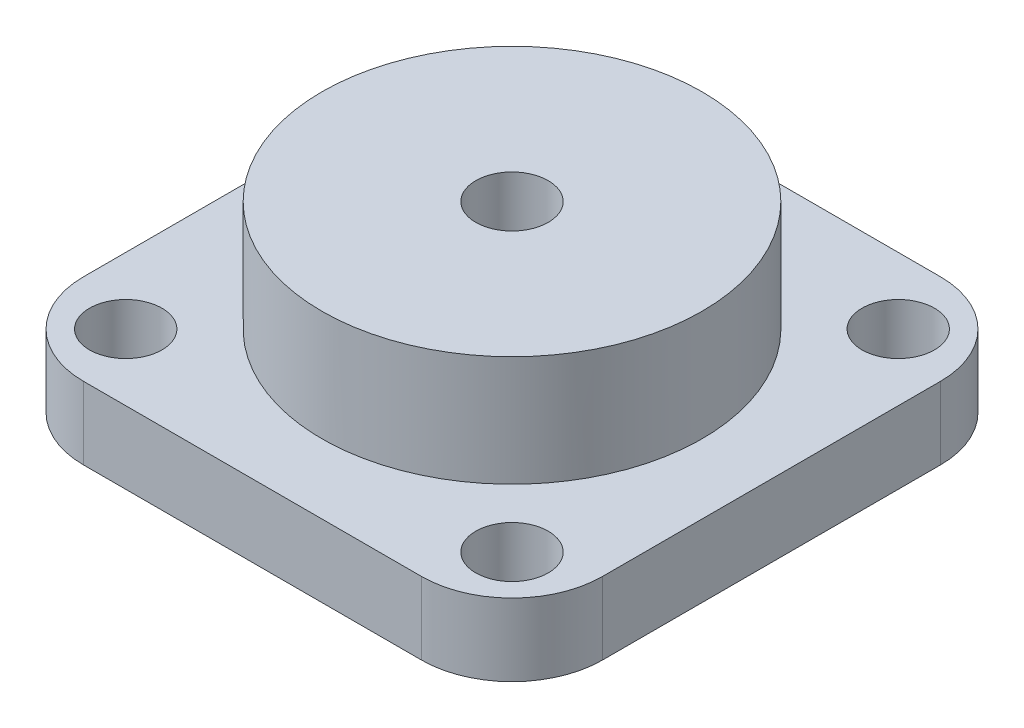
ISO-10303-21;
HEADER;
FILE_DESCRIPTION(('STEP AP214'),'2;1');
FILE_NAME('part.step','',(''),(''),'','','');
FILE_SCHEMA(('AUTOMOTIVE_DESIGN { 1 0 10303 214 1 1 1 1 }'));
ENDSEC;
DATA;
#1=APPLICATION_CONTEXT('core data for automotive mechanical design processes');
#2=APPLICATION_PROTOCOL_DEFINITION('international standard','automotive_design',2000,#1);
#3=PRODUCT_CONTEXT('',#1,'mechanical');
#4=PRODUCT('Part','Part','',(#3));
#5=PRODUCT_RELATED_PRODUCT_CATEGORY('part','',(#4));
#6=PRODUCT_DEFINITION_FORMATION('','',#4);
#7=PRODUCT_DEFINITION_CONTEXT('part definition',#1,'design');
#8=PRODUCT_DEFINITION('design','',#6,#7);
#9=PRODUCT_DEFINITION_SHAPE('','',#8);
#10=(LENGTH_UNIT() NAMED_UNIT(*) SI_UNIT(.MILLI.,.METRE.));
#11=(NAMED_UNIT(*) PLANE_ANGLE_UNIT() SI_UNIT($,.RADIAN.));
#12=(NAMED_UNIT(*) SI_UNIT($,.STERADIAN.) SOLID_ANGLE_UNIT());
#13=UNCERTAINTY_MEASURE_WITH_UNIT(LENGTH_MEASURE(1.E-05),#10,'distance_accuracy_value','');
#14=(GEOMETRIC_REPRESENTATION_CONTEXT(3) GLOBAL_UNCERTAINTY_ASSIGNED_CONTEXT((#13)) GLOBAL_UNIT_ASSIGNED_CONTEXT((#10,
#11,#12)) REPRESENTATION_CONTEXT('',''));
#15=CARTESIAN_POINT('',(0.,0.,0.));
#16=DIRECTION('',(0.,0.,1.));
#17=DIRECTION('',(1.,0.,0.));
#18=AXIS2_PLACEMENT_3D('',#15,#16,#17);
#19=CARTESIAN_POINT('',(-15.,12.,15.));
#20=DIRECTION('',(0.,-1.,0.));
#21=DIRECTION('',(0.,0.,-1.));
#22=AXIS2_PLACEMENT_3D('',#19,#20,#21);
#23=CYLINDRICAL_SURFACE('',#22,15.);
#24=CARTESIAN_POINT('',(-15.,0.,15.));
#25=DIRECTION('',(0.,1.,0.));
#26=DIRECTION('',(0.,0.,-1.));
#27=AXIS2_PLACEMENT_3D('',#24,#25,#26);
#28=CIRCLE('',#27,15.);
#29=CARTESIAN_POINT('',(0.,0.,15.0000000000001));
#30=VERTEX_POINT('',#29);
#31=CARTESIAN_POINT('',(-15.0000000000001,0.,0.));
#32=VERTEX_POINT('',#31);
#33=EDGE_CURVE('E141',#30,#32,#28,.T.);
#34=ORIENTED_EDGE('',*,*,#33,.T.);
#35=DIRECTION('',(0.,-1.,0.));
#36=VECTOR('',#35,1.);
#37=CARTESIAN_POINT('',(-15.0000000000001,12.,0.));
#38=LINE('',#37,#36);
#39=CARTESIAN_POINT('',(-15.0000000000001,12.,0.));
#40=VERTEX_POINT('',#39);
#41=EDGE_CURVE('E48',#40,#32,#38,.T.);
#42=ORIENTED_EDGE('',*,*,#41,.F.);
#43=CARTESIAN_POINT('',(-15.,12.,15.));
#44=DIRECTION('',(0.,1.,0.));
#45=DIRECTION('',(0.,0.,-1.));
#46=AXIS2_PLACEMENT_3D('',#43,#44,#45);
#47=CIRCLE('',#46,15.);
#48=CARTESIAN_POINT('',(0.,12.,15.0000000000001));
#49=VERTEX_POINT('',#48);
#50=EDGE_CURVE('E164',#49,#40,#47,.T.);
#51=ORIENTED_EDGE('',*,*,#50,.F.);
#52=DIRECTION('',(0.,-1.,0.));
#53=VECTOR('',#52,1.);
#54=CARTESIAN_POINT('',(0.,12.,15.0000000000001));
#55=LINE('',#54,#53);
#56=EDGE_CURVE('E137',#49,#30,#55,.T.);
#57=ORIENTED_EDGE('',*,*,#56,.T.);
#58=EDGE_LOOP('',(#34,#42,#51,#57));
#59=FACE_BOUND('',#58,.T.);
#60=ADVANCED_FACE('F39',(#59),#23,.T.);
#61=CARTESIAN_POINT('',(-15.0000000000001,12.,0.));
#62=DIRECTION('',(0.,0.,1.));
#63=DIRECTION('',(1.,0.,0.));
#64=AXIS2_PLACEMENT_3D('',#61,#62,#63);
#65=PLANE('',#64);
#66=DIRECTION('',(-1.,0.,0.));
#67=VECTOR('',#66,1.);
#68=CARTESIAN_POINT('',(-15.0000000000001,0.,0.));
#69=LINE('',#68,#67);
#70=CARTESIAN_POINT('',(-70.9999999999999,0.,0.));
#71=VERTEX_POINT('',#70);
#72=EDGE_CURVE('E145',#32,#71,#69,.T.);
#73=ORIENTED_EDGE('',*,*,#72,.T.);
#74=DIRECTION('',(0.,-1.,0.));
#75=VECTOR('',#74,1.);
#76=CARTESIAN_POINT('',(-70.9999999999999,12.,0.));
#77=LINE('',#76,#75);
#78=CARTESIAN_POINT('',(-70.9999999999999,12.,0.));
#79=VERTEX_POINT('',#78);
#80=EDGE_CURVE('E179',#79,#71,#77,.T.);
#81=ORIENTED_EDGE('',*,*,#80,.F.);
#82=DIRECTION('',(-1.,0.,0.));
#83=VECTOR('',#82,1.);
#84=CARTESIAN_POINT('',(-15.0000000000001,12.,0.));
#85=LINE('',#84,#83);
#86=EDGE_CURVE('E100',#40,#79,#85,.T.);
#87=ORIENTED_EDGE('',*,*,#86,.F.);
#88=ORIENTED_EDGE('',*,*,#41,.T.);
#89=EDGE_LOOP('',(#73,#81,#87,#88));
#90=FACE_BOUND('',#89,.T.);
#91=ADVANCED_FACE('F184',(#90),#65,.F.);
#92=CARTESIAN_POINT('',(-71.,12.,15.));
#93=DIRECTION('',(0.,-1.,0.));
#94=DIRECTION('',(0.,0.,-1.));
#95=AXIS2_PLACEMENT_3D('',#92,#93,#94);
#96=CYLINDRICAL_SURFACE('',#95,15.);
#97=CARTESIAN_POINT('',(-71.,0.,15.));
#98=DIRECTION('',(0.,1.,0.));
#99=DIRECTION('',(0.,0.,1.));
#100=AXIS2_PLACEMENT_3D('',#97,#98,#99);
#101=CIRCLE('',#100,15.);
#102=CARTESIAN_POINT('',(-86.,0.,15.0000000000001));
#103=VERTEX_POINT('',#102);
#104=EDGE_CURVE('E149',#71,#103,#101,.T.);
#105=ORIENTED_EDGE('',*,*,#104,.T.);
#106=DIRECTION('',(0.,-1.,0.));
#107=VECTOR('',#106,1.);
#108=CARTESIAN_POINT('',(-86.,12.,15.0000000000001));
#109=LINE('',#108,#107);
#110=CARTESIAN_POINT('',(-86.,12.,15.0000000000001));
#111=VERTEX_POINT('',#110);
#112=EDGE_CURVE('E175',#111,#103,#109,.T.);
#113=ORIENTED_EDGE('',*,*,#112,.F.);
#114=CARTESIAN_POINT('',(-71.,12.,15.));
#115=DIRECTION('',(0.,1.,0.));
#116=DIRECTION('',(0.,0.,1.));
#117=AXIS2_PLACEMENT_3D('',#114,#115,#116);
#118=CIRCLE('',#117,15.);
#119=EDGE_CURVE('E203',#79,#111,#118,.T.);
#120=ORIENTED_EDGE('',*,*,#119,.F.);
#121=ORIENTED_EDGE('',*,*,#80,.T.);
#122=EDGE_LOOP('',(#105,#113,#120,#121));
#123=FACE_BOUND('',#122,.T.);
#124=ADVANCED_FACE('F195',(#123),#96,.T.);
#125=CARTESIAN_POINT('',(-86.,12.,15.0000000000001));
#126=DIRECTION('',(1.,0.,0.));
#127=DIRECTION('',(0.,0.,-1.));
#128=AXIS2_PLACEMENT_3D('',#125,#126,#127);
#129=PLANE('',#128);
#130=DIRECTION('',(0.,0.,1.));
#131=VECTOR('',#130,1.);
#132=CARTESIAN_POINT('',(-86.,0.,15.0000000000001));
#133=LINE('',#132,#131);
#134=CARTESIAN_POINT('',(-86.,0.,70.9999999999999));
#135=VERTEX_POINT('',#134);
#136=EDGE_CURVE('E152',#103,#135,#133,.T.);
#137=ORIENTED_EDGE('',*,*,#136,.T.);
#138=DIRECTION('',(0.,-1.,0.));
#139=VECTOR('',#138,1.);
#140=CARTESIAN_POINT('',(-86.,12.,70.9999999999999));
#141=LINE('',#140,#139);
#142=CARTESIAN_POINT('',(-86.,12.,70.9999999999999));
#143=VERTEX_POINT('',#142);
#144=EDGE_CURVE('E171',#143,#135,#141,.T.);
#145=ORIENTED_EDGE('',*,*,#144,.F.);
#146=DIRECTION('',(0.,0.,1.));
#147=VECTOR('',#146,1.);
#148=CARTESIAN_POINT('',(-86.,12.,15.0000000000001));
#149=LINE('',#148,#147);
#150=EDGE_CURVE('E201',#111,#143,#149,.T.);
#151=ORIENTED_EDGE('',*,*,#150,.F.);
#152=ORIENTED_EDGE('',*,*,#112,.T.);
#153=EDGE_LOOP('',(#137,#145,#151,#152));
#154=FACE_BOUND('',#153,.T.);
#155=ADVANCED_FACE('F199',(#154),#129,.F.);
#156=CARTESIAN_POINT('',(-71.,12.,71.));
#157=DIRECTION('',(0.,-1.,0.));
#158=DIRECTION('',(0.,0.,-1.));
#159=AXIS2_PLACEMENT_3D('',#156,#157,#158);
#160=CYLINDRICAL_SURFACE('',#159,15.);
#161=CARTESIAN_POINT('',(-71.,0.,71.));
#162=DIRECTION('',(0.,1.,0.));
#163=DIRECTION('',(0.,0.,-1.));
#164=AXIS2_PLACEMENT_3D('',#161,#162,#163);
#165=CIRCLE('',#164,15.);
#166=CARTESIAN_POINT('',(-70.9999999999999,0.,86.));
#167=VERTEX_POINT('',#166);
#168=EDGE_CURVE('E155',#135,#167,#165,.T.);
#169=ORIENTED_EDGE('',*,*,#168,.T.);
#170=DIRECTION('',(0.,-1.,0.));
#171=VECTOR('',#170,1.);
#172=CARTESIAN_POINT('',(-70.9999999999999,12.,86.));
#173=LINE('',#172,#171);
#174=CARTESIAN_POINT('',(-70.9999999999999,12.,86.));
#175=VERTEX_POINT('',#174);
#176=EDGE_CURVE('E130',#175,#167,#173,.T.);
#177=ORIENTED_EDGE('',*,*,#176,.F.);
#178=CARTESIAN_POINT('',(-71.,12.,71.));
#179=DIRECTION('',(0.,1.,0.));
#180=DIRECTION('',(0.,0.,-1.));
#181=AXIS2_PLACEMENT_3D('',#178,#179,#180);
#182=CIRCLE('',#181,15.);
#183=EDGE_CURVE('E119',#143,#175,#182,.T.);
#184=ORIENTED_EDGE('',*,*,#183,.F.);
#185=ORIENTED_EDGE('',*,*,#144,.T.);
#186=EDGE_LOOP('',(#169,#177,#184,#185));
#187=FACE_BOUND('',#186,.T.);
#188=ADVANCED_FACE('F316',(#187),#160,.T.);
#189=CARTESIAN_POINT('',(-15.0000000000001,12.,86.));
#190=DIRECTION('',(0.,0.,-1.));
#191=DIRECTION('',(-1.,0.,0.));
#192=AXIS2_PLACEMENT_3D('',#189,#190,#191);
#193=PLANE('',#192);
#194=DIRECTION('',(1.,0.,0.));
#195=VECTOR('',#194,1.);
#196=CARTESIAN_POINT('',(-15.0000000000001,0.,86.));
#197=LINE('',#196,#195);
#198=CARTESIAN_POINT('',(-15.0000000000001,0.,86.));
#199=VERTEX_POINT('',#198);
#200=EDGE_CURVE('E128',#167,#199,#197,.T.);
#201=ORIENTED_EDGE('',*,*,#200,.T.);
#202=DIRECTION('',(0.,-1.,0.));
#203=VECTOR('',#202,1.);
#204=CARTESIAN_POINT('',(-15.0000000000001,12.,86.));
#205=LINE('',#204,#203);
#206=CARTESIAN_POINT('',(-15.0000000000001,12.,86.));
#207=VERTEX_POINT('',#206);
#208=EDGE_CURVE('E125',#207,#199,#205,.T.);
#209=ORIENTED_EDGE('',*,*,#208,.F.);
#210=DIRECTION('',(1.,0.,0.));
#211=VECTOR('',#210,1.);
#212=CARTESIAN_POINT('',(-15.0000000000001,12.,86.));
#213=LINE('',#212,#211);
#214=EDGE_CURVE('E113',#175,#207,#213,.T.);
#215=ORIENTED_EDGE('',*,*,#214,.F.);
#216=ORIENTED_EDGE('',*,*,#176,.T.);
#217=EDGE_LOOP('',(#201,#209,#215,#216));
#218=FACE_BOUND('',#217,.T.);
#219=ADVANCED_FACE('F126',(#218),#193,.F.);
#220=CARTESIAN_POINT('',(-15.,12.,71.));
#221=DIRECTION('',(0.,-1.,0.));
#222=DIRECTION('',(0.,0.,-1.));
#223=AXIS2_PLACEMENT_3D('',#220,#221,#222);
#224=CYLINDRICAL_SURFACE('',#223,15.);
#225=CARTESIAN_POINT('',(-15.,0.,71.));
#226=DIRECTION('',(0.,1.,0.));
#227=DIRECTION('',(0.,0.,-1.));
#228=AXIS2_PLACEMENT_3D('',#225,#226,#227);
#229=CIRCLE('',#228,15.);
#230=CARTESIAN_POINT('',(0.,0.,70.9999999999999));
#231=VERTEX_POINT('',#230);
#232=EDGE_CURVE('E85',#199,#231,#229,.T.);
#233=ORIENTED_EDGE('',*,*,#232,.T.);
#234=DIRECTION('',(0.,-1.,0.));
#235=VECTOR('',#234,1.);
#236=CARTESIAN_POINT('',(0.,12.,70.9999999999999));
#237=LINE('',#236,#235);
#238=CARTESIAN_POINT('',(0.,12.,70.9999999999999));
#239=VERTEX_POINT('',#238);
#240=EDGE_CURVE('E131',#239,#231,#237,.T.);
#241=ORIENTED_EDGE('',*,*,#240,.F.);
#242=CARTESIAN_POINT('',(-15.,12.,71.));
#243=DIRECTION('',(0.,1.,0.));
#244=DIRECTION('',(0.,0.,-1.));
#245=AXIS2_PLACEMENT_3D('',#242,#243,#244);
#246=CIRCLE('',#245,15.);
#247=EDGE_CURVE('E117',#207,#239,#246,.T.);
#248=ORIENTED_EDGE('',*,*,#247,.F.);
#249=ORIENTED_EDGE('',*,*,#208,.T.);
#250=EDGE_LOOP('',(#233,#241,#248,#249));
#251=FACE_BOUND('',#250,.T.);
#252=ADVANCED_FACE('F133',(#251),#224,.T.);
#253=CARTESIAN_POINT('',(0.,12.,15.0000000000001));
#254=DIRECTION('',(-1.,0.,0.));
#255=DIRECTION('',(0.,0.,1.));
#256=AXIS2_PLACEMENT_3D('',#253,#254,#255);
#257=PLANE('',#256);
#258=DIRECTION('',(0.,0.,-1.));
#259=VECTOR('',#258,1.);
#260=CARTESIAN_POINT('',(0.,0.,15.0000000000001));
#261=LINE('',#260,#259);
#262=EDGE_CURVE('E91',#231,#30,#261,.T.);
#263=ORIENTED_EDGE('',*,*,#262,.T.);
#264=ORIENTED_EDGE('',*,*,#56,.F.);
#265=DIRECTION('',(0.,0.,-1.));
#266=VECTOR('',#265,1.);
#267=CARTESIAN_POINT('',(0.,12.,15.0000000000001));
#268=LINE('',#267,#266);
#269=EDGE_CURVE('E56',#239,#49,#268,.T.);
#270=ORIENTED_EDGE('',*,*,#269,.F.);
#271=ORIENTED_EDGE('',*,*,#240,.T.);
#272=EDGE_LOOP('',(#263,#264,#270,#271));
#273=FACE_BOUND('',#272,.T.);
#274=ADVANCED_FACE('F280',(#273),#257,.F.);
#275=CARTESIAN_POINT('',(-15.,12.,15.));
#276=DIRECTION('',(0.,-1.,0.));
#277=DIRECTION('',(0.,0.,-1.));
#278=AXIS2_PLACEMENT_3D('',#275,#276,#277);
#279=PLANE('',#278);
#280=CARTESIAN_POINT('',(-43.,12.,43.));
#281=DIRECTION('',(0.,-1.,0.));
#282=DIRECTION('',(0.,0.,-1.));
#283=AXIS2_PLACEMENT_3D('',#280,#281,#282);
#284=CIRCLE('',#283,31.5);
#285=CARTESIAN_POINT('',(-43.,12.,11.5));
#286=VERTEX_POINT('',#285);
#287=EDGE_CURVE('E11',#286,#286,#284,.F.);
#288=ORIENTED_EDGE('',*,*,#287,.F.);
#289=EDGE_LOOP('',(#288));
#290=FACE_BOUND('',#289,.T.);
#291=CARTESIAN_POINT('',(-75.,12.,75.));
#292=DIRECTION('',(0.,1.,0.));
#293=DIRECTION('',(0.,0.,1.));
#294=AXIS2_PLACEMENT_3D('',#291,#292,#293);
#295=CIRCLE('',#294,6.);
#296=CARTESIAN_POINT('',(-75.,12.,81.));
#297=VERTEX_POINT('',#296);
#298=EDGE_CURVE('E221',#297,#297,#295,.T.);
#299=ORIENTED_EDGE('',*,*,#298,.F.);
#300=EDGE_LOOP('',(#299));
#301=FACE_BOUND('',#300,.T.);
#302=CARTESIAN_POINT('',(-11.,12.,75.));
#303=DIRECTION('',(0.,1.,0.));
#304=DIRECTION('',(0.,0.,1.));
#305=AXIS2_PLACEMENT_3D('',#302,#303,#304);
#306=CIRCLE('',#305,6.);
#307=CARTESIAN_POINT('',(-11.,12.,81.));
#308=VERTEX_POINT('',#307);
#309=EDGE_CURVE('E230',#308,#308,#306,.T.);
#310=ORIENTED_EDGE('',*,*,#309,.F.);
#311=EDGE_LOOP('',(#310));
#312=FACE_BOUND('',#311,.T.);
#313=CARTESIAN_POINT('',(-11.,12.,11.));
#314=DIRECTION('',(0.,1.,0.));
#315=DIRECTION('',(0.,0.,1.));
#316=AXIS2_PLACEMENT_3D('',#313,#314,#315);
#317=CIRCLE('',#316,6.);
#318=CARTESIAN_POINT('',(-11.,12.,17.));
#319=VERTEX_POINT('',#318);
#320=EDGE_CURVE('E238',#319,#319,#317,.T.);
#321=ORIENTED_EDGE('',*,*,#320,.F.);
#322=EDGE_LOOP('',(#321));
#323=FACE_BOUND('',#322,.T.);
#324=CARTESIAN_POINT('',(-75.,12.,11.));
#325=DIRECTION('',(0.,1.,0.));
#326=DIRECTION('',(0.,0.,1.));
#327=AXIS2_PLACEMENT_3D('',#324,#325,#326);
#328=CIRCLE('',#327,6.);
#329=CARTESIAN_POINT('',(-75.,12.,17.));
#330=VERTEX_POINT('',#329);
#331=EDGE_CURVE('E213',#330,#330,#328,.T.);
#332=ORIENTED_EDGE('',*,*,#331,.F.);
#333=EDGE_LOOP('',(#332));
#334=FACE_BOUND('',#333,.T.);
#335=ORIENTED_EDGE('',*,*,#50,.T.);
#336=ORIENTED_EDGE('',*,*,#86,.T.);
#337=ORIENTED_EDGE('',*,*,#119,.T.);
#338=ORIENTED_EDGE('',*,*,#150,.T.);
#339=ORIENTED_EDGE('',*,*,#183,.T.);
#340=ORIENTED_EDGE('',*,*,#214,.T.);
#341=ORIENTED_EDGE('',*,*,#247,.T.);
#342=ORIENTED_EDGE('',*,*,#269,.T.);
#343=EDGE_LOOP('',(#335,#336,#337,#338,#339,#340,#341,#342));
#344=FACE_BOUND('',#343,.T.);
#345=ADVANCED_FACE('F115',(#290,#301,#312,#323,#334,#344),#279,.F.);
#346=CARTESIAN_POINT('',(-15.,0.,15.));
#347=DIRECTION('',(0.,-1.,0.));
#348=DIRECTION('',(0.,0.,-1.));
#349=AXIS2_PLACEMENT_3D('',#346,#347,#348);
#350=PLANE('',#349);
#351=CARTESIAN_POINT('',(-43.,0.,43.));
#352=DIRECTION('',(0.,1.,0.));
#353=DIRECTION('',(0.,0.,1.));
#354=AXIS2_PLACEMENT_3D('',#351,#352,#353);
#355=CIRCLE('',#354,6.);
#356=CARTESIAN_POINT('',(-43.,0.,49.));
#357=VERTEX_POINT('',#356);
#358=EDGE_CURVE('E248',#357,#357,#355,.T.);
#359=ORIENTED_EDGE('',*,*,#358,.T.);
#360=EDGE_LOOP('',(#359));
#361=FACE_BOUND('',#360,.T.);
#362=CARTESIAN_POINT('',(-75.,0.,75.));
#363=DIRECTION('',(0.,1.,0.));
#364=DIRECTION('',(0.,0.,1.));
#365=AXIS2_PLACEMENT_3D('',#362,#363,#364);
#366=CIRCLE('',#365,6.);
#367=CARTESIAN_POINT('',(-75.,0.,81.));
#368=VERTEX_POINT('',#367);
#369=EDGE_CURVE('E225',#368,#368,#366,.T.);
#370=ORIENTED_EDGE('',*,*,#369,.T.);
#371=EDGE_LOOP('',(#370));
#372=FACE_BOUND('',#371,.T.);
#373=CARTESIAN_POINT('',(-11.,0.,75.));
#374=DIRECTION('',(0.,1.,0.));
#375=DIRECTION('',(0.,0.,1.));
#376=AXIS2_PLACEMENT_3D('',#373,#374,#375);
#377=CIRCLE('',#376,6.);
#378=CARTESIAN_POINT('',(-11.,0.,81.));
#379=VERTEX_POINT('',#378);
#380=EDGE_CURVE('E234',#379,#379,#377,.T.);
#381=ORIENTED_EDGE('',*,*,#380,.T.);
#382=EDGE_LOOP('',(#381));
#383=FACE_BOUND('',#382,.T.);
#384=CARTESIAN_POINT('',(-11.,0.,11.));
#385=DIRECTION('',(0.,1.,0.));
#386=DIRECTION('',(0.,0.,1.));
#387=AXIS2_PLACEMENT_3D('',#384,#385,#386);
#388=CIRCLE('',#387,6.);
#389=CARTESIAN_POINT('',(-11.,0.,17.));
#390=VERTEX_POINT('',#389);
#391=EDGE_CURVE('E217',#390,#390,#388,.T.);
#392=ORIENTED_EDGE('',*,*,#391,.T.);
#393=EDGE_LOOP('',(#392));
#394=FACE_BOUND('',#393,.T.);
#395=CARTESIAN_POINT('',(-75.,0.,11.));
#396=DIRECTION('',(0.,1.,0.));
#397=DIRECTION('',(0.,0.,1.));
#398=AXIS2_PLACEMENT_3D('',#395,#396,#397);
#399=CIRCLE('',#398,6.);
#400=CARTESIAN_POINT('',(-75.,0.,17.));
#401=VERTEX_POINT('',#400);
#402=EDGE_CURVE('E146',#401,#401,#399,.T.);
#403=ORIENTED_EDGE('',*,*,#402,.T.);
#404=EDGE_LOOP('',(#403));
#405=FACE_BOUND('',#404,.T.);
#406=ORIENTED_EDGE('',*,*,#33,.F.);
#407=ORIENTED_EDGE('',*,*,#262,.F.);
#408=ORIENTED_EDGE('',*,*,#232,.F.);
#409=ORIENTED_EDGE('',*,*,#200,.F.);
#410=ORIENTED_EDGE('',*,*,#168,.F.);
#411=ORIENTED_EDGE('',*,*,#136,.F.);
#412=ORIENTED_EDGE('',*,*,#104,.F.);
#413=ORIENTED_EDGE('',*,*,#72,.F.);
#414=EDGE_LOOP('',(#406,#407,#408,#409,#410,#411,#412,#413));
#415=FACE_BOUND('',#414,.T.);
#416=ADVANCED_FACE('F189',(#361,#372,#383,#394,#405,#415),#350,.T.);
#417=CARTESIAN_POINT('',(-75.,0.,11.));
#418=DIRECTION('',(0.,1.,0.));
#419=DIRECTION('',(0.,0.,1.));
#420=AXIS2_PLACEMENT_3D('',#417,#418,#419);
#421=CYLINDRICAL_SURFACE('',#420,6.);
#422=ORIENTED_EDGE('',*,*,#402,.F.);
#423=EDGE_LOOP('',(#422));
#424=FACE_BOUND('',#423,.T.);
#425=ORIENTED_EDGE('',*,*,#331,.T.);
#426=EDGE_LOOP('',(#425));
#427=FACE_BOUND('',#426,.T.);
#428=ADVANCED_FACE('F290',(#424,#427),#421,.F.);
#429=CARTESIAN_POINT('',(-11.,0.,11.));
#430=DIRECTION('',(0.,1.,0.));
#431=DIRECTION('',(0.,0.,1.));
#432=AXIS2_PLACEMENT_3D('',#429,#430,#431);
#433=CYLINDRICAL_SURFACE('',#432,6.);
#434=ORIENTED_EDGE('',*,*,#391,.F.);
#435=EDGE_LOOP('',(#434));
#436=FACE_BOUND('',#435,.T.);
#437=ORIENTED_EDGE('',*,*,#320,.T.);
#438=EDGE_LOOP('',(#437));
#439=FACE_BOUND('',#438,.T.);
#440=ADVANCED_FACE('F292',(#436,#439),#433,.F.);
#441=CARTESIAN_POINT('',(-11.,0.,75.));
#442=DIRECTION('',(0.,1.,0.));
#443=DIRECTION('',(0.,0.,1.));
#444=AXIS2_PLACEMENT_3D('',#441,#442,#443);
#445=CYLINDRICAL_SURFACE('',#444,6.);
#446=ORIENTED_EDGE('',*,*,#380,.F.);
#447=EDGE_LOOP('',(#446));
#448=FACE_BOUND('',#447,.T.);
#449=ORIENTED_EDGE('',*,*,#309,.T.);
#450=EDGE_LOOP('',(#449));
#451=FACE_BOUND('',#450,.T.);
#452=ADVANCED_FACE('F299',(#448,#451),#445,.F.);
#453=CARTESIAN_POINT('',(-75.,0.,75.));
#454=DIRECTION('',(0.,1.,0.));
#455=DIRECTION('',(0.,0.,1.));
#456=AXIS2_PLACEMENT_3D('',#453,#454,#455);
#457=CYLINDRICAL_SURFACE('',#456,6.);
#458=ORIENTED_EDGE('',*,*,#369,.F.);
#459=EDGE_LOOP('',(#458));
#460=FACE_BOUND('',#459,.T.);
#461=ORIENTED_EDGE('',*,*,#298,.T.);
#462=EDGE_LOOP('',(#461));
#463=FACE_BOUND('',#462,.T.);
#464=ADVANCED_FACE('F274',(#460,#463),#457,.F.);
#465=CARTESIAN_POINT('',(-43.,30.3,43.));
#466=DIRECTION('',(0.,-1.,0.));
#467=DIRECTION('',(0.,0.,-1.));
#468=AXIS2_PLACEMENT_3D('',#465,#466,#467);
#469=CYLINDRICAL_SURFACE('',#468,31.5);
#470=CARTESIAN_POINT('',(-43.,30.3,43.));
#471=DIRECTION('',(0.,1.,0.));
#472=DIRECTION('',(0.,0.,1.));
#473=AXIS2_PLACEMENT_3D('',#470,#471,#472);
#474=CIRCLE('',#473,31.5);
#475=CARTESIAN_POINT('',(-43.,30.3,74.5));
#476=VERTEX_POINT('',#475);
#477=EDGE_CURVE('E226',#476,#476,#474,.T.);
#478=ORIENTED_EDGE('',*,*,#477,.F.);
#479=EDGE_LOOP('',(#478));
#480=FACE_BOUND('',#479,.T.);
#481=ORIENTED_EDGE('',*,*,#287,.T.);
#482=EDGE_LOOP('',(#481));
#483=FACE_BOUND('',#482,.T.);
#484=ADVANCED_FACE('F268',(#480,#483),#469,.T.);
#485=CARTESIAN_POINT('',(-43.,30.3,43.));
#486=DIRECTION('',(0.,1.,0.));
#487=DIRECTION('',(0.,0.,1.));
#488=AXIS2_PLACEMENT_3D('',#485,#486,#487);
#489=PLANE('',#488);
#490=CARTESIAN_POINT('',(-43.,30.3,43.));
#491=DIRECTION('',(0.,1.,0.));
#492=DIRECTION('',(0.,0.,1.));
#493=AXIS2_PLACEMENT_3D('',#490,#491,#492);
#494=CIRCLE('',#493,6.);
#495=CARTESIAN_POINT('',(-43.,30.3,49.));
#496=VERTEX_POINT('',#495);
#497=EDGE_CURVE('E249',#496,#496,#494,.T.);
#498=ORIENTED_EDGE('',*,*,#497,.F.);
#499=EDGE_LOOP('',(#498));
#500=FACE_BOUND('',#499,.T.);
#501=ORIENTED_EDGE('',*,*,#477,.T.);
#502=EDGE_LOOP('',(#501));
#503=FACE_BOUND('',#502,.T.);
#504=ADVANCED_FACE('F262',(#500,#503),#489,.T.);
#505=CARTESIAN_POINT('',(-43.,0.,43.));
#506=DIRECTION('',(0.,1.,0.));
#507=DIRECTION('',(0.,0.,1.));
#508=AXIS2_PLACEMENT_3D('',#505,#506,#507);
#509=CYLINDRICAL_SURFACE('',#508,6.);
#510=ORIENTED_EDGE('',*,*,#358,.F.);
#511=EDGE_LOOP('',(#510));
#512=FACE_BOUND('',#511,.T.);
#513=ORIENTED_EDGE('',*,*,#497,.T.);
#514=EDGE_LOOP('',(#513));
#515=FACE_BOUND('',#514,.T.);
#516=ADVANCED_FACE('F259',(#512,#515),#509,.F.);
#517=CLOSED_SHELL('',(#60,#91,#124,#155,#188,#219,#252,#274,#345,#416,#428,#440,#452,#464,#484,
#504,#516));
#518=MANIFOLD_SOLID_BREP('B2',#517);
#519=ADVANCED_BREP_SHAPE_REPRESENTATION('',(#18,#518),#14);
#520=SHAPE_DEFINITION_REPRESENTATION(#9,#519);
ENDSEC;
END-ISO-10303-21;
